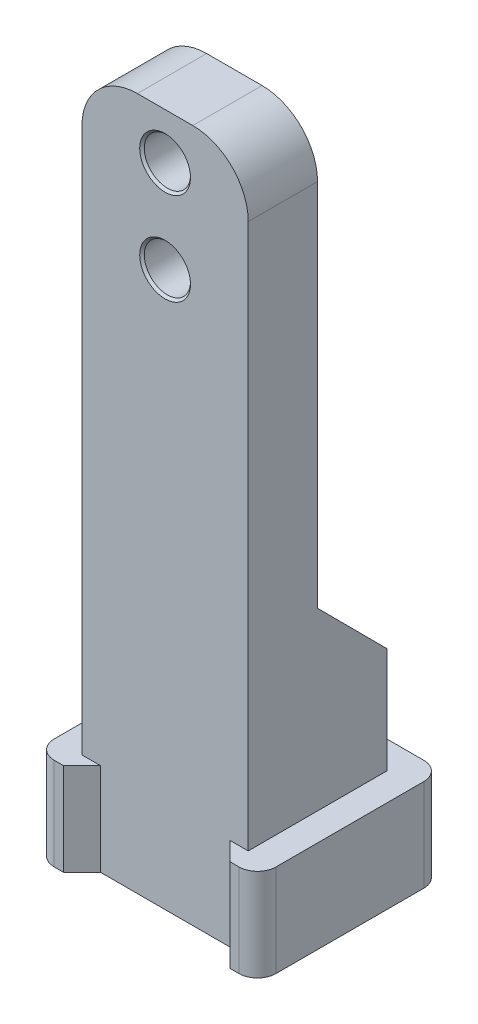
ISO-10303-21;
HEADER;
FILE_DESCRIPTION(('STEP AP214'),'2;1');
FILE_NAME('part.step','',(''),(''),'','','');
FILE_SCHEMA(('AUTOMOTIVE_DESIGN { 1 0 10303 214 1 1 1 1 }'));
ENDSEC;
DATA;
#1=APPLICATION_CONTEXT('core data for automotive mechanical design processes');
#2=APPLICATION_PROTOCOL_DEFINITION('international standard','automotive_design',2000,#1);
#3=PRODUCT_CONTEXT('',#1,'mechanical');
#4=PRODUCT('Part','Part','',(#3));
#5=PRODUCT_RELATED_PRODUCT_CATEGORY('part','',(#4));
#6=PRODUCT_DEFINITION_FORMATION('','',#4);
#7=PRODUCT_DEFINITION_CONTEXT('part definition',#1,'design');
#8=PRODUCT_DEFINITION('design','',#6,#7);
#9=PRODUCT_DEFINITION_SHAPE('','',#8);
#10=(LENGTH_UNIT() NAMED_UNIT(*) SI_UNIT(.MILLI.,.METRE.));
#11=(NAMED_UNIT(*) PLANE_ANGLE_UNIT() SI_UNIT($,.RADIAN.));
#12=(NAMED_UNIT(*) SI_UNIT($,.STERADIAN.) SOLID_ANGLE_UNIT());
#13=UNCERTAINTY_MEASURE_WITH_UNIT(LENGTH_MEASURE(1.E-05),#10,'distance_accuracy_value','');
#14=(GEOMETRIC_REPRESENTATION_CONTEXT(3) GLOBAL_UNCERTAINTY_ASSIGNED_CONTEXT((#13)) GLOBAL_UNIT_ASSIGNED_CONTEXT((#10,
#11,#12)) REPRESENTATION_CONTEXT('',''));
#15=CARTESIAN_POINT('',(0.,0.,0.));
#16=DIRECTION('',(0.,0.,1.));
#17=DIRECTION('',(1.,0.,0.));
#18=AXIS2_PLACEMENT_3D('',#15,#16,#17);
#19=CARTESIAN_POINT('',(0.,75.,0.));
#20=DIRECTION('',(1.,0.,0.));
#21=DIRECTION('',(0.,0.,-1.));
#22=AXIS2_PLACEMENT_3D('',#19,#20,#21);
#23=PLANE('',#22);
#24=DIRECTION('',(0.,0.,1.));
#25=VECTOR('',#24,1.);
#26=CARTESIAN_POINT('',(0.,10.,0.));
#27=LINE('',#26,#25);
#28=CARTESIAN_POINT('',(0.,9.99999999999999,-15.));
#29=VERTEX_POINT('',#28);
#30=CARTESIAN_POINT('',(0.,9.99999999999999,0.));
#31=VERTEX_POINT('',#30);
#32=EDGE_CURVE('E208',#29,#31,#27,.T.);
#33=ORIENTED_EDGE('',*,*,#32,.T.);
#34=DIRECTION('',(0.,-1.,0.));
#35=VECTOR('',#34,1.);
#36=CARTESIAN_POINT('',(0.,75.,0.));
#37=LINE('',#36,#35);
#38=CARTESIAN_POINT('',(0.,69.,0.));
#39=VERTEX_POINT('',#38);
#40=EDGE_CURVE('E353',#39,#31,#37,.T.);
#41=ORIENTED_EDGE('',*,*,#40,.F.);
#42=DIRECTION('',(0.,0.,1.));
#43=VECTOR('',#42,1.);
#44=CARTESIAN_POINT('',(0.,69.,0.));
#45=LINE('',#44,#43);
#46=CARTESIAN_POINT('',(0.,69.,-7.5));
#47=VERTEX_POINT('',#46);
#48=EDGE_CURVE('E384',#39,#47,#45,.F.);
#49=ORIENTED_EDGE('',*,*,#48,.T.);
#50=DIRECTION('',(0.,-1.,0.));
#51=VECTOR('',#50,1.);
#52=CARTESIAN_POINT('',(0.,75.,-7.5));
#53=LINE('',#52,#51);
#54=CARTESIAN_POINT('',(0.,29.,-7.50000000000001));
#55=VERTEX_POINT('',#54);
#56=EDGE_CURVE('E331',#47,#55,#53,.T.);
#57=ORIENTED_EDGE('',*,*,#56,.T.);
#58=DIRECTION('',(0.,-0.708419964654757,-0.705791154434902));
#59=VECTOR('',#58,1.);
#60=CARTESIAN_POINT('',(0.,55.8354810158747,19.2358997077962));
#61=LINE('',#60,#59);
#62=CARTESIAN_POINT('',(0.,21.4720652823076,-15.));
#63=VERTEX_POINT('',#62);
#64=EDGE_CURVE('E323',#55,#63,#61,.T.);
#65=ORIENTED_EDGE('',*,*,#64,.T.);
#66=DIRECTION('',(0.,-1.,0.));
#67=VECTOR('',#66,1.);
#68=CARTESIAN_POINT('',(0.,75.,-15.));
#69=LINE('',#68,#67);
#70=EDGE_CURVE('E338',#63,#29,#69,.T.);
#71=ORIENTED_EDGE('',*,*,#70,.T.);
#72=EDGE_LOOP('',(#33,#41,#49,#57,#65,#71));
#73=FACE_BOUND('',#72,.T.);
#74=ADVANCED_FACE('F44',(#73),#23,.F.);
#75=CARTESIAN_POINT('',(18.,75.,0.));
#76=DIRECTION('',(-1.,0.,0.));
#77=DIRECTION('',(0.,0.,1.));
#78=AXIS2_PLACEMENT_3D('',#75,#76,#77);
#79=PLANE('',#78);
#80=DIRECTION('',(0.,0.,-1.));
#81=VECTOR('',#80,1.);
#82=CARTESIAN_POINT('',(18.,10.,0.));
#83=LINE('',#82,#81);
#84=CARTESIAN_POINT('',(18.,9.99999999999999,0.));
#85=VERTEX_POINT('',#84);
#86=CARTESIAN_POINT('',(18.,9.99999999999999,-15.));
#87=VERTEX_POINT('',#86);
#88=EDGE_CURVE('E425',#85,#87,#83,.T.);
#89=ORIENTED_EDGE('',*,*,#88,.T.);
#90=DIRECTION('',(0.,-1.,0.));
#91=VECTOR('',#90,1.);
#92=CARTESIAN_POINT('',(18.,75.,-15.));
#93=LINE('',#92,#91);
#94=CARTESIAN_POINT('',(18.,21.4720652823076,-15.));
#95=VERTEX_POINT('',#94);
#96=EDGE_CURVE('E345',#95,#87,#93,.T.);
#97=ORIENTED_EDGE('',*,*,#96,.F.);
#98=DIRECTION('',(0.,-0.708419964654757,-0.705791154434902));
#99=VECTOR('',#98,1.);
#100=CARTESIAN_POINT('',(18.,29.,-7.50000000000001));
#101=LINE('',#100,#99);
#102=CARTESIAN_POINT('',(18.,29.,-7.50000000000001));
#103=VERTEX_POINT('',#102);
#104=EDGE_CURVE('E460',#103,#95,#101,.T.);
#105=ORIENTED_EDGE('',*,*,#104,.F.);
#106=DIRECTION('',(0.,-1.,0.));
#107=VECTOR('',#106,1.);
#108=CARTESIAN_POINT('',(18.,75.,-7.5));
#109=LINE('',#108,#107);
#110=CARTESIAN_POINT('',(18.,69.,-7.5));
#111=VERTEX_POINT('',#110);
#112=EDGE_CURVE('E370',#111,#103,#109,.T.);
#113=ORIENTED_EDGE('',*,*,#112,.F.);
#114=DIRECTION('',(0.,0.,-1.));
#115=VECTOR('',#114,1.);
#116=CARTESIAN_POINT('',(18.,69.,0.));
#117=LINE('',#116,#115);
#118=CARTESIAN_POINT('',(18.,69.,0.));
#119=VERTEX_POINT('',#118);
#120=EDGE_CURVE('E393',#111,#119,#117,.F.);
#121=ORIENTED_EDGE('',*,*,#120,.T.);
#122=DIRECTION('',(0.,-1.,0.));
#123=VECTOR('',#122,1.);
#124=CARTESIAN_POINT('',(18.,75.,0.));
#125=LINE('',#124,#123);
#126=EDGE_CURVE('E349',#119,#85,#125,.T.);
#127=ORIENTED_EDGE('',*,*,#126,.T.);
#128=EDGE_LOOP('',(#89,#97,#105,#113,#121,#127));
#129=FACE_BOUND('',#128,.T.);
#130=ADVANCED_FACE('F423',(#129),#79,.F.);
#131=CARTESIAN_POINT('',(0.,75.,-15.));
#132=DIRECTION('',(0.,0.,1.));
#133=DIRECTION('',(1.,0.,0.));
#134=AXIS2_PLACEMENT_3D('',#131,#132,#133);
#135=PLANE('',#134);
#136=DIRECTION('',(-1.,0.,0.));
#137=VECTOR('',#136,1.);
#138=CARTESIAN_POINT('',(0.,10.,-15.));
#139=LINE('',#138,#137);
#140=EDGE_CURVE('E198',#87,#29,#139,.T.);
#141=ORIENTED_EDGE('',*,*,#140,.T.);
#142=ORIENTED_EDGE('',*,*,#70,.F.);
#143=DIRECTION('',(1.,0.,0.));
#144=VECTOR('',#143,1.);
#145=CARTESIAN_POINT('',(-30.,21.4720652823076,-15.));
#146=LINE('',#145,#144);
#147=EDGE_CURVE('E464',#63,#95,#146,.T.);
#148=ORIENTED_EDGE('',*,*,#147,.T.);
#149=ORIENTED_EDGE('',*,*,#96,.T.);
#150=EDGE_LOOP('',(#141,#142,#148,#149));
#151=FACE_BOUND('',#150,.T.);
#152=ADVANCED_FACE('F533',(#151),#135,.F.);
#153=CARTESIAN_POINT('',(0.,75.,0.));
#154=DIRECTION('',(0.,0.,-1.));
#155=DIRECTION('',(-1.,0.,0.));
#156=AXIS2_PLACEMENT_3D('',#153,#154,#155);
#157=PLANE('',#156);
#158=CARTESIAN_POINT('',(9.,70.,0.));
#159=DIRECTION('',(0.,0.,-1.));
#160=DIRECTION('',(-1.,0.,0.));
#161=AXIS2_PLACEMENT_3D('',#158,#159,#160);
#162=CIRCLE('',#161,2.74999999999998);
#163=CARTESIAN_POINT('',(6.25000000000002,70.,0.));
#164=VERTEX_POINT('',#163);
#165=EDGE_CURVE('E284',#164,#164,#162,.T.);
#166=ORIENTED_EDGE('',*,*,#165,.T.);
#167=EDGE_LOOP('',(#166));
#168=FACE_BOUND('',#167,.T.);
#169=CARTESIAN_POINT('',(9.,60.,0.));
#170=DIRECTION('',(0.,0.,-1.));
#171=DIRECTION('',(-1.,0.,0.));
#172=AXIS2_PLACEMENT_3D('',#169,#170,#171);
#173=CIRCLE('',#172,2.75);
#174=CARTESIAN_POINT('',(6.25,60.,0.));
#175=VERTEX_POINT('',#174);
#176=EDGE_CURVE('E280',#175,#175,#173,.T.);
#177=ORIENTED_EDGE('',*,*,#176,.T.);
#178=EDGE_LOOP('',(#177));
#179=FACE_BOUND('',#178,.T.);
#180=DIRECTION('',(1.,0.,0.));
#181=VECTOR('',#180,1.);
#182=CARTESIAN_POINT('',(0.,10.,0.));
#183=LINE('',#182,#181);
#184=CARTESIAN_POINT('',(2.00000000000001,10.,0.));
#185=VERTEX_POINT('',#184);
#186=EDGE_CURVE('E403',#31,#185,#183,.T.);
#187=ORIENTED_EDGE('',*,*,#186,.T.);
#188=DIRECTION('',(0.,-1.,0.));
#189=VECTOR('',#188,1.);
#190=CARTESIAN_POINT('',(2.00000000000001,75.,0.));
#191=LINE('',#190,#189);
#192=CARTESIAN_POINT('',(2.00000000000001,0.,0.));
#193=VERTEX_POINT('',#192);
#194=EDGE_CURVE('E213',#185,#193,#191,.T.);
#195=ORIENTED_EDGE('',*,*,#194,.T.);
#196=DIRECTION('',(1.,0.,0.));
#197=VECTOR('',#196,1.);
#198=CARTESIAN_POINT('',(0.,0.,0.));
#199=LINE('',#198,#197);
#200=CARTESIAN_POINT('',(16.,0.,0.));
#201=VERTEX_POINT('',#200);
#202=EDGE_CURVE('E328',#193,#201,#199,.T.);
#203=ORIENTED_EDGE('',*,*,#202,.T.);
#204=DIRECTION('',(0.,1.,0.));
#205=VECTOR('',#204,1.);
#206=CARTESIAN_POINT('',(16.,75.,0.));
#207=LINE('',#206,#205);
#208=CARTESIAN_POINT('',(16.,10.,0.));
#209=VERTEX_POINT('',#208);
#210=EDGE_CURVE('E399',#201,#209,#207,.T.);
#211=ORIENTED_EDGE('',*,*,#210,.T.);
#212=DIRECTION('',(1.,0.,0.));
#213=VECTOR('',#212,1.);
#214=CARTESIAN_POINT('',(0.,10.,0.));
#215=LINE('',#214,#213);
#216=EDGE_CURVE('E396',#209,#85,#215,.T.);
#217=ORIENTED_EDGE('',*,*,#216,.T.);
#218=ORIENTED_EDGE('',*,*,#126,.F.);
#219=CARTESIAN_POINT('',(12.,69.,0.));
#220=DIRECTION('',(0.,0.,-1.));
#221=DIRECTION('',(-1.,0.,0.));
#222=AXIS2_PLACEMENT_3D('',#219,#220,#221);
#223=CIRCLE('',#222,6.);
#224=CARTESIAN_POINT('',(12.,75.,0.));
#225=VERTEX_POINT('',#224);
#226=EDGE_CURVE('E378',#119,#225,#223,.F.);
#227=ORIENTED_EDGE('',*,*,#226,.T.);
#228=DIRECTION('',(1.,0.,0.));
#229=VECTOR('',#228,1.);
#230=CARTESIAN_POINT('',(0.,75.,0.));
#231=LINE('',#230,#229);
#232=CARTESIAN_POINT('',(6.,75.,0.));
#233=VERTEX_POINT('',#232);
#234=EDGE_CURVE('E334',#233,#225,#231,.T.);
#235=ORIENTED_EDGE('',*,*,#234,.F.);
#236=CARTESIAN_POINT('',(6.,69.,0.));
#237=DIRECTION('',(0.,0.,-1.));
#238=DIRECTION('',(-1.,0.,0.));
#239=AXIS2_PLACEMENT_3D('',#236,#237,#238);
#240=CIRCLE('',#239,6.);
#241=EDGE_CURVE('E381',#233,#39,#240,.F.);
#242=ORIENTED_EDGE('',*,*,#241,.T.);
#243=ORIENTED_EDGE('',*,*,#40,.T.);
#244=EDGE_LOOP('',(#187,#195,#203,#211,#217,#218,#227,#235,#242,#243));
#245=FACE_BOUND('',#244,.T.);
#246=ADVANCED_FACE('F408',(#168,#179,#245),#157,.F.);
#247=CARTESIAN_POINT('',(0.,75.,0.));
#248=DIRECTION('',(0.,-1.,0.));
#249=DIRECTION('',(0.,0.,-1.));
#250=AXIS2_PLACEMENT_3D('',#247,#248,#249);
#251=PLANE('',#250);
#252=DIRECTION('',(-1.,0.,0.));
#253=VECTOR('',#252,1.);
#254=CARTESIAN_POINT('',(0.,75.,-7.5));
#255=LINE('',#254,#253);
#256=CARTESIAN_POINT('',(12.,75.,-7.5));
#257=VERTEX_POINT('',#256);
#258=CARTESIAN_POINT('',(6.,75.,-7.5));
#259=VERTEX_POINT('',#258);
#260=EDGE_CURVE('E357',#257,#259,#255,.T.);
#261=ORIENTED_EDGE('',*,*,#260,.T.);
#262=DIRECTION('',(0.,0.,1.));
#263=VECTOR('',#262,1.);
#264=CARTESIAN_POINT('',(6.,75.,0.));
#265=LINE('',#264,#263);
#266=EDGE_CURVE('E374',#259,#233,#265,.T.);
#267=ORIENTED_EDGE('',*,*,#266,.T.);
#268=ORIENTED_EDGE('',*,*,#234,.T.);
#269=DIRECTION('',(0.,0.,-1.));
#270=VECTOR('',#269,1.);
#271=CARTESIAN_POINT('',(12.,75.,0.));
#272=LINE('',#271,#270);
#273=EDGE_CURVE('E361',#225,#257,#272,.T.);
#274=ORIENTED_EDGE('',*,*,#273,.T.);
#275=EDGE_LOOP('',(#261,#267,#268,#274));
#276=FACE_BOUND('',#275,.T.);
#277=ADVANCED_FACE('F492',(#276),#251,.F.);
#278=CARTESIAN_POINT('',(0.,0.,0.));
#279=DIRECTION('',(0.,-1.,0.));
#280=DIRECTION('',(0.,0.,-1.));
#281=AXIS2_PLACEMENT_3D('',#278,#279,#280);
#282=PLANE('',#281);
#283=CARTESIAN_POINT('',(14.,0.,-6.));
#284=DIRECTION('',(0.,-1.,0.));
#285=DIRECTION('',(0.,0.,-1.));
#286=AXIS2_PLACEMENT_3D('',#283,#284,#285);
#287=CIRCLE('',#286,2.75);
#288=CARTESIAN_POINT('',(14.,0.,-8.75));
#289=VERTEX_POINT('',#288);
#290=EDGE_CURVE('E54',#289,#289,#287,.F.);
#291=ORIENTED_EDGE('',*,*,#290,.T.);
#292=EDGE_LOOP('',(#291));
#293=FACE_BOUND('',#292,.T.);
#294=CARTESIAN_POINT('',(4.,0.,-6.));
#295=DIRECTION('',(0.,-1.,0.));
#296=DIRECTION('',(0.,0.,-1.));
#297=AXIS2_PLACEMENT_3D('',#294,#295,#296);
#298=CIRCLE('',#297,2.75);
#299=CARTESIAN_POINT('',(4.,0.,-8.75));
#300=VERTEX_POINT('',#299);
#301=EDGE_CURVE('E296',#300,#300,#298,.F.);
#302=ORIENTED_EDGE('',*,*,#301,.T.);
#303=EDGE_LOOP('',(#302));
#304=FACE_BOUND('',#303,.T.);
#305=DIRECTION('',(-1.,0.,0.));
#306=VECTOR('',#305,1.);
#307=CARTESIAN_POINT('',(0.,0.,2.));
#308=LINE('',#307,#306);
#309=CARTESIAN_POINT('',(0.,0.,2.));
#310=VERTEX_POINT('',#309);
#311=CARTESIAN_POINT('',(-1.,0.,2.));
#312=VERTEX_POINT('',#311);
#313=EDGE_CURVE('E193',#310,#312,#308,.T.);
#314=ORIENTED_EDGE('',*,*,#313,.T.);
#315=CARTESIAN_POINT('',(-1.,0.,0.));
#316=DIRECTION('',(0.,-1.,0.));
#317=DIRECTION('',(0.,0.,-1.));
#318=AXIS2_PLACEMENT_3D('',#315,#316,#317);
#319=CIRCLE('',#318,2.);
#320=CARTESIAN_POINT('',(-3.,0.,0.));
#321=VERTEX_POINT('',#320);
#322=EDGE_CURVE('E240',#312,#321,#319,.T.);
#323=ORIENTED_EDGE('',*,*,#322,.T.);
#324=DIRECTION('',(0.,0.,-1.));
#325=VECTOR('',#324,1.);
#326=CARTESIAN_POINT('',(-3.,0.,2.));
#327=LINE('',#326,#325);
#328=CARTESIAN_POINT('',(-3.,0.,-16.));
#329=VERTEX_POINT('',#328);
#330=EDGE_CURVE('E442',#321,#329,#327,.T.);
#331=ORIENTED_EDGE('',*,*,#330,.T.);
#332=CARTESIAN_POINT('',(-0.999999999999998,0.,-16.));
#333=DIRECTION('',(0.,-1.,0.));
#334=DIRECTION('',(0.,0.,-1.));
#335=AXIS2_PLACEMENT_3D('',#332,#333,#334);
#336=CIRCLE('',#335,2.);
#337=CARTESIAN_POINT('',(-0.999999999999997,0.,-18.));
#338=VERTEX_POINT('',#337);
#339=EDGE_CURVE('E231',#329,#338,#336,.T.);
#340=ORIENTED_EDGE('',*,*,#339,.T.);
#341=DIRECTION('',(1.,0.,0.));
#342=VECTOR('',#341,1.);
#343=CARTESIAN_POINT('',(21.,0.,-18.));
#344=LINE('',#343,#342);
#345=CARTESIAN_POINT('',(19.,0.,-18.));
#346=VERTEX_POINT('',#345);
#347=EDGE_CURVE('E446',#338,#346,#344,.T.);
#348=ORIENTED_EDGE('',*,*,#347,.T.);
#349=CARTESIAN_POINT('',(19.,0.,-16.));
#350=DIRECTION('',(0.,-1.,0.));
#351=DIRECTION('',(0.,0.,-1.));
#352=AXIS2_PLACEMENT_3D('',#349,#350,#351);
#353=CIRCLE('',#352,2.);
#354=CARTESIAN_POINT('',(21.,0.,-16.));
#355=VERTEX_POINT('',#354);
#356=EDGE_CURVE('E234',#346,#355,#353,.T.);
#357=ORIENTED_EDGE('',*,*,#356,.T.);
#358=DIRECTION('',(0.,0.,1.));
#359=VECTOR('',#358,1.);
#360=CARTESIAN_POINT('',(21.,0.,2.));
#361=LINE('',#360,#359);
#362=CARTESIAN_POINT('',(21.,0.,0.));
#363=VERTEX_POINT('',#362);
#364=EDGE_CURVE('E450',#355,#363,#361,.T.);
#365=ORIENTED_EDGE('',*,*,#364,.T.);
#366=CARTESIAN_POINT('',(19.,0.,0.));
#367=DIRECTION('',(0.,-1.,0.));
#368=DIRECTION('',(0.,0.,-1.));
#369=AXIS2_PLACEMENT_3D('',#366,#367,#368);
#370=CIRCLE('',#369,2.);
#371=CARTESIAN_POINT('',(19.,0.,2.));
#372=VERTEX_POINT('',#371);
#373=EDGE_CURVE('E237',#363,#372,#370,.T.);
#374=ORIENTED_EDGE('',*,*,#373,.T.);
#375=DIRECTION('',(-1.,0.,0.));
#376=VECTOR('',#375,1.);
#377=CARTESIAN_POINT('',(18.,0.,2.));
#378=LINE('',#377,#376);
#379=CARTESIAN_POINT('',(18.,0.,2.));
#380=VERTEX_POINT('',#379);
#381=EDGE_CURVE('E413',#372,#380,#378,.T.);
#382=ORIENTED_EDGE('',*,*,#381,.T.);
#383=DIRECTION('',(-0.707106781186551,0.,-0.707106781186544));
#384=VECTOR('',#383,1.);
#385=CARTESIAN_POINT('',(16.,0.,0.));
#386=LINE('',#385,#384);
#387=EDGE_CURVE('E221',#380,#201,#386,.T.);
#388=ORIENTED_EDGE('',*,*,#387,.T.);
#389=ORIENTED_EDGE('',*,*,#202,.F.);
#390=DIRECTION('',(-0.707106781186551,0.,0.707106781186544));
#391=VECTOR('',#390,1.);
#392=CARTESIAN_POINT('',(2.00000000000001,0.,0.));
#393=LINE('',#392,#391);
#394=EDGE_CURVE('E216',#193,#310,#393,.T.);
#395=ORIENTED_EDGE('',*,*,#394,.T.);
#396=EDGE_LOOP('',(#314,#323,#331,#340,#348,#357,#365,#374,#382,#388,#389,#395));
#397=FACE_BOUND('',#396,.T.);
#398=ADVANCED_FACE('F303',(#293,#304,#397),#282,.T.);
#399=CARTESIAN_POINT('',(14.,12.,-6.));
#400=DIRECTION('',(0.,-1.,0.));
#401=DIRECTION('',(0.,0.,-1.));
#402=AXIS2_PLACEMENT_3D('',#399,#400,#401);
#403=CYLINDRICAL_SURFACE('',#402,2.5);
#404=CARTESIAN_POINT('',(14.,0.249999999999999,-6.));
#405=DIRECTION('',(0.,-1.,0.));
#406=DIRECTION('',(0.,0.,-1.));
#407=AXIS2_PLACEMENT_3D('',#404,#405,#406);
#408=CIRCLE('',#407,2.5);
#409=CARTESIAN_POINT('',(14.,0.249999999999999,-8.5));
#410=VERTEX_POINT('',#409);
#411=EDGE_CURVE('E292',#410,#410,#408,.T.);
#412=ORIENTED_EDGE('',*,*,#411,.T.);
#413=EDGE_LOOP('',(#412));
#414=FACE_BOUND('',#413,.T.);
#415=CARTESIAN_POINT('',(14.,12.,-6.));
#416=DIRECTION('',(0.,-1.,0.));
#417=DIRECTION('',(0.,0.,-1.));
#418=AXIS2_PLACEMENT_3D('',#415,#416,#417);
#419=CIRCLE('',#418,2.5);
#420=CARTESIAN_POINT('',(14.,12.,-8.5));
#421=VERTEX_POINT('',#420);
#422=EDGE_CURVE('E319',#421,#421,#419,.T.);
#423=ORIENTED_EDGE('',*,*,#422,.F.);
#424=EDGE_LOOP('',(#423));
#425=FACE_BOUND('',#424,.T.);
#426=ADVANCED_FACE('F312',(#414,#425),#403,.F.);
#427=CARTESIAN_POINT('',(0.,12.,0.));
#428=DIRECTION('',(0.,-1.,0.));
#429=DIRECTION('',(0.,0.,-1.));
#430=AXIS2_PLACEMENT_3D('',#427,#428,#429);
#431=PLANE('',#430);
#432=ORIENTED_EDGE('',*,*,#422,.T.);
#433=EDGE_LOOP('',(#432));
#434=FACE_BOUND('',#433,.T.);
#435=ADVANCED_FACE('F315',(#434),#431,.T.);
#436=CARTESIAN_POINT('',(4.,12.,-6.));
#437=DIRECTION('',(0.,-1.,0.));
#438=DIRECTION('',(0.,0.,-1.));
#439=AXIS2_PLACEMENT_3D('',#436,#437,#438);
#440=CYLINDRICAL_SURFACE('',#439,2.5);
#441=CARTESIAN_POINT('',(4.,0.249999999999997,-6.));
#442=DIRECTION('',(0.,-1.,0.));
#443=DIRECTION('',(0.,0.,-1.));
#444=AXIS2_PLACEMENT_3D('',#441,#442,#443);
#445=CIRCLE('',#444,2.5);
#446=CARTESIAN_POINT('',(4.,0.249999999999997,-8.5));
#447=VERTEX_POINT('',#446);
#448=EDGE_CURVE('E11',#447,#447,#445,.T.);
#449=ORIENTED_EDGE('',*,*,#448,.T.);
#450=EDGE_LOOP('',(#449));
#451=FACE_BOUND('',#450,.T.);
#452=CARTESIAN_POINT('',(4.,12.,-6.));
#453=DIRECTION('',(0.,-1.,0.));
#454=DIRECTION('',(0.,0.,-1.));
#455=AXIS2_PLACEMENT_3D('',#452,#453,#454);
#456=CIRCLE('',#455,2.5);
#457=CARTESIAN_POINT('',(4.,12.,-8.5));
#458=VERTEX_POINT('',#457);
#459=EDGE_CURVE('E322',#458,#458,#456,.T.);
#460=ORIENTED_EDGE('',*,*,#459,.F.);
#461=EDGE_LOOP('',(#460));
#462=FACE_BOUND('',#461,.T.);
#463=ADVANCED_FACE('F605',(#451,#462),#440,.F.);
#464=CARTESIAN_POINT('',(0.,12.,0.));
#465=DIRECTION('',(0.,-1.,0.));
#466=DIRECTION('',(0.,0.,-1.));
#467=AXIS2_PLACEMENT_3D('',#464,#465,#466);
#468=PLANE('',#467);
#469=ORIENTED_EDGE('',*,*,#459,.T.);
#470=EDGE_LOOP('',(#469));
#471=FACE_BOUND('',#470,.T.);
#472=ADVANCED_FACE('F600',(#471),#468,.T.);
#473=CARTESIAN_POINT('',(-30.,29.,-7.50000000000001));
#474=DIRECTION('',(0.,-0.705791154434902,0.708419964654757));
#475=DIRECTION('',(0.,-0.708419964654757,-0.705791154434902));
#476=AXIS2_PLACEMENT_3D('',#473,#474,#475);
#477=PLANE('',#476);
#478=DIRECTION('',(1.,0.,0.));
#479=VECTOR('',#478,1.);
#480=CARTESIAN_POINT('',(-30.,29.,-7.50000000000001));
#481=LINE('',#480,#479);
#482=EDGE_CURVE('E463',#55,#103,#481,.T.);
#483=ORIENTED_EDGE('',*,*,#482,.T.);
#484=ORIENTED_EDGE('',*,*,#104,.T.);
#485=ORIENTED_EDGE('',*,*,#147,.F.);
#486=ORIENTED_EDGE('',*,*,#64,.F.);
#487=EDGE_LOOP('',(#483,#484,#485,#486));
#488=FACE_BOUND('',#487,.T.);
#489=ADVANCED_FACE('F483',(#488),#477,.F.);
#490=CARTESIAN_POINT('',(-30.,75.,-7.5));
#491=DIRECTION('',(0.,0.,1.));
#492=DIRECTION('',(0.,-1.,0.));
#493=AXIS2_PLACEMENT_3D('',#490,#491,#492);
#494=PLANE('',#493);
#495=CARTESIAN_POINT('',(9.,70.,-7.5));
#496=DIRECTION('',(0.,0.,1.));
#497=DIRECTION('',(0.,-1.,0.));
#498=AXIS2_PLACEMENT_3D('',#495,#496,#497);
#499=CIRCLE('',#498,2.5);
#500=CARTESIAN_POINT('',(9.,67.5,-7.5));
#501=VERTEX_POINT('',#500);
#502=EDGE_CURVE('E366',#501,#501,#499,.T.);
#503=ORIENTED_EDGE('',*,*,#502,.T.);
#504=EDGE_LOOP('',(#503));
#505=FACE_BOUND('',#504,.T.);
#506=CARTESIAN_POINT('',(9.,60.,-7.5));
#507=DIRECTION('',(0.,0.,1.));
#508=DIRECTION('',(0.,-1.,0.));
#509=AXIS2_PLACEMENT_3D('',#506,#507,#508);
#510=CIRCLE('',#509,2.5);
#511=CARTESIAN_POINT('',(9.,57.5,-7.5));
#512=VERTEX_POINT('',#511);
#513=EDGE_CURVE('E362',#512,#512,#510,.T.);
#514=ORIENTED_EDGE('',*,*,#513,.T.);
#515=EDGE_LOOP('',(#514));
#516=FACE_BOUND('',#515,.T.);
#517=ORIENTED_EDGE('',*,*,#56,.F.);
#518=CARTESIAN_POINT('',(6.,69.,-7.5));
#519=DIRECTION('',(0.,0.,1.));
#520=DIRECTION('',(0.,-1.,0.));
#521=AXIS2_PLACEMENT_3D('',#518,#519,#520);
#522=CIRCLE('',#521,6.);
#523=EDGE_CURVE('E390',#47,#259,#522,.F.);
#524=ORIENTED_EDGE('',*,*,#523,.T.);
#525=ORIENTED_EDGE('',*,*,#260,.F.);
#526=CARTESIAN_POINT('',(12.,69.,-7.5));
#527=DIRECTION('',(0.,0.,1.));
#528=DIRECTION('',(0.,-1.,0.));
#529=AXIS2_PLACEMENT_3D('',#526,#527,#528);
#530=CIRCLE('',#529,6.);
#531=EDGE_CURVE('E387',#257,#111,#530,.F.);
#532=ORIENTED_EDGE('',*,*,#531,.T.);
#533=ORIENTED_EDGE('',*,*,#112,.T.);
#534=ORIENTED_EDGE('',*,*,#482,.F.);
#535=EDGE_LOOP('',(#517,#524,#525,#532,#533,#534));
#536=FACE_BOUND('',#535,.T.);
#537=ADVANCED_FACE('F485',(#505,#516,#536),#494,.F.);
#538=CARTESIAN_POINT('',(9.,60.,-48.));
#539=DIRECTION('',(0.,0.,1.));
#540=DIRECTION('',(1.,0.,0.));
#541=AXIS2_PLACEMENT_3D('',#538,#539,#540);
#542=CYLINDRICAL_SURFACE('',#541,2.5);
#543=CARTESIAN_POINT('',(9.,60.,-0.25));
#544=DIRECTION('',(0.,0.,-1.));
#545=DIRECTION('',(-1.,0.,0.));
#546=AXIS2_PLACEMENT_3D('',#543,#544,#545);
#547=CIRCLE('',#546,2.5);
#548=CARTESIAN_POINT('',(6.5,60.,-0.25));
#549=VERTEX_POINT('',#548);
#550=EDGE_CURVE('E288',#549,#549,#547,.F.);
#551=ORIENTED_EDGE('',*,*,#550,.T.);
#552=EDGE_LOOP('',(#551));
#553=FACE_BOUND('',#552,.T.);
#554=ORIENTED_EDGE('',*,*,#513,.F.);
#555=EDGE_LOOP('',(#554));
#556=FACE_BOUND('',#555,.T.);
#557=ADVANCED_FACE('F587',(#553,#556),#542,.F.);
#558=CARTESIAN_POINT('',(9.,70.,-48.));
#559=DIRECTION('',(0.,0.,1.));
#560=DIRECTION('',(1.,0.,0.));
#561=AXIS2_PLACEMENT_3D('',#558,#559,#560);
#562=CYLINDRICAL_SURFACE('',#561,2.5);
#563=CARTESIAN_POINT('',(9.,70.,-0.249999999999986));
#564=DIRECTION('',(0.,0.,-1.));
#565=DIRECTION('',(-1.,0.,0.));
#566=AXIS2_PLACEMENT_3D('',#563,#564,#565);
#567=CIRCLE('',#566,2.5);
#568=CARTESIAN_POINT('',(6.5,70.,-0.249999999999986));
#569=VERTEX_POINT('',#568);
#570=EDGE_CURVE('E276',#569,#569,#567,.F.);
#571=ORIENTED_EDGE('',*,*,#570,.T.);
#572=EDGE_LOOP('',(#571));
#573=FACE_BOUND('',#572,.T.);
#574=ORIENTED_EDGE('',*,*,#502,.F.);
#575=EDGE_LOOP('',(#574));
#576=FACE_BOUND('',#575,.T.);
#577=ADVANCED_FACE('F538',(#573,#576),#562,.F.);
#578=CARTESIAN_POINT('',(6.,69.,0.));
#579=DIRECTION('',(0.,0.,1.));
#580=DIRECTION('',(1.,0.,0.));
#581=AXIS2_PLACEMENT_3D('',#578,#579,#580);
#582=CYLINDRICAL_SURFACE('',#581,6.);
#583=ORIENTED_EDGE('',*,*,#523,.F.);
#584=ORIENTED_EDGE('',*,*,#48,.F.);
#585=ORIENTED_EDGE('',*,*,#241,.F.);
#586=ORIENTED_EDGE('',*,*,#266,.F.);
#587=EDGE_LOOP('',(#583,#584,#585,#586));
#588=FACE_BOUND('',#587,.T.);
#589=ADVANCED_FACE('F495',(#588),#582,.T.);
#590=CARTESIAN_POINT('',(12.,69.,0.));
#591=DIRECTION('',(0.,0.,-1.));
#592=DIRECTION('',(-1.,0.,0.));
#593=AXIS2_PLACEMENT_3D('',#590,#591,#592);
#594=CYLINDRICAL_SURFACE('',#593,6.);
#595=ORIENTED_EDGE('',*,*,#226,.F.);
#596=ORIENTED_EDGE('',*,*,#120,.F.);
#597=ORIENTED_EDGE('',*,*,#531,.F.);
#598=ORIENTED_EDGE('',*,*,#273,.F.);
#599=EDGE_LOOP('',(#595,#596,#597,#598));
#600=FACE_BOUND('',#599,.T.);
#601=ADVANCED_FACE('F488',(#600),#594,.T.);
#602=CARTESIAN_POINT('',(18.,10.,2.));
#603=DIRECTION('',(0.,0.,1.));
#604=DIRECTION('',(1.,0.,0.));
#605=AXIS2_PLACEMENT_3D('',#602,#603,#604);
#606=PLANE('',#605);
#607=ORIENTED_EDGE('',*,*,#381,.F.);
#608=DIRECTION('',(0.,-1.,0.));
#609=VECTOR('',#608,1.);
#610=CARTESIAN_POINT('',(19.,10.,2.));
#611=LINE('',#610,#609);
#612=CARTESIAN_POINT('',(19.,10.,2.));
#613=VERTEX_POINT('',#612);
#614=EDGE_CURVE('E267',#372,#613,#611,.F.);
#615=ORIENTED_EDGE('',*,*,#614,.T.);
#616=DIRECTION('',(-1.,0.,0.));
#617=VECTOR('',#616,1.);
#618=CARTESIAN_POINT('',(18.,10.,2.));
#619=LINE('',#618,#617);
#620=CARTESIAN_POINT('',(18.,10.,2.));
#621=VERTEX_POINT('',#620);
#622=EDGE_CURVE('E431',#613,#621,#619,.T.);
#623=ORIENTED_EDGE('',*,*,#622,.T.);
#624=DIRECTION('',(0.,-1.,0.));
#625=VECTOR('',#624,1.);
#626=CARTESIAN_POINT('',(18.,10.,2.));
#627=LINE('',#626,#625);
#628=EDGE_CURVE('E197',#621,#380,#627,.T.);
#629=ORIENTED_EDGE('',*,*,#628,.T.);
#630=EDGE_LOOP('',(#607,#615,#623,#629));
#631=FACE_BOUND('',#630,.T.);
#632=ADVANCED_FACE('F516',(#631),#606,.T.);
#633=CARTESIAN_POINT('',(21.,10.,2.));
#634=DIRECTION('',(1.,0.,0.));
#635=DIRECTION('',(0.,0.,-1.));
#636=AXIS2_PLACEMENT_3D('',#633,#634,#635);
#637=PLANE('',#636);
#638=DIRECTION('',(0.,0.,1.));
#639=VECTOR('',#638,1.);
#640=CARTESIAN_POINT('',(21.,10.,2.));
#641=LINE('',#640,#639);
#642=CARTESIAN_POINT('',(21.,10.,-16.));
#643=VERTEX_POINT('',#642);
#644=CARTESIAN_POINT('',(21.,10.,0.));
#645=VERTEX_POINT('',#644);
#646=EDGE_CURVE('E436',#643,#645,#641,.T.);
#647=ORIENTED_EDGE('',*,*,#646,.T.);
#648=DIRECTION('',(0.,-1.,0.));
#649=VECTOR('',#648,1.);
#650=CARTESIAN_POINT('',(21.,10.,0.));
#651=LINE('',#650,#649);
#652=EDGE_CURVE('E263',#645,#363,#651,.T.);
#653=ORIENTED_EDGE('',*,*,#652,.T.);
#654=ORIENTED_EDGE('',*,*,#364,.F.);
#655=DIRECTION('',(0.,-1.,0.));
#656=VECTOR('',#655,1.);
#657=CARTESIAN_POINT('',(21.,10.,-16.));
#658=LINE('',#657,#656);
#659=EDGE_CURVE('E260',#355,#643,#658,.F.);
#660=ORIENTED_EDGE('',*,*,#659,.T.);
#661=EDGE_LOOP('',(#647,#653,#654,#660));
#662=FACE_BOUND('',#661,.T.);
#663=ADVANCED_FACE('F508',(#662),#637,.T.);
#664=CARTESIAN_POINT('',(21.,10.,-18.));
#665=DIRECTION('',(0.,0.,-1.));
#666=DIRECTION('',(-1.,0.,0.));
#667=AXIS2_PLACEMENT_3D('',#664,#665,#666);
#668=PLANE('',#667);
#669=DIRECTION('',(1.,0.,0.));
#670=VECTOR('',#669,1.);
#671=CARTESIAN_POINT('',(21.,10.,-18.));
#672=LINE('',#671,#670);
#673=CARTESIAN_POINT('',(-0.999999999999997,10.,-18.));
#674=VERTEX_POINT('',#673);
#675=CARTESIAN_POINT('',(19.,10.,-18.));
#676=VERTEX_POINT('',#675);
#677=EDGE_CURVE('E502',#674,#676,#672,.T.);
#678=ORIENTED_EDGE('',*,*,#677,.T.);
#679=DIRECTION('',(0.,-1.,0.));
#680=VECTOR('',#679,1.);
#681=CARTESIAN_POINT('',(19.,10.,-18.));
#682=LINE('',#681,#680);
#683=EDGE_CURVE('E272',#676,#346,#682,.T.);
#684=ORIENTED_EDGE('',*,*,#683,.T.);
#685=ORIENTED_EDGE('',*,*,#347,.F.);
#686=DIRECTION('',(0.,-1.,0.));
#687=VECTOR('',#686,1.);
#688=CARTESIAN_POINT('',(-0.999999999999997,10.,-18.));
#689=LINE('',#688,#687);
#690=EDGE_CURVE('E68',#338,#674,#689,.F.);
#691=ORIENTED_EDGE('',*,*,#690,.T.);
#692=EDGE_LOOP('',(#678,#684,#685,#691));
#693=FACE_BOUND('',#692,.T.);
#694=ADVANCED_FACE('F524',(#693),#668,.T.);
#695=CARTESIAN_POINT('',(-3.,10.,2.));
#696=DIRECTION('',(-1.,0.,0.));
#697=DIRECTION('',(0.,0.,1.));
#698=AXIS2_PLACEMENT_3D('',#695,#696,#697);
#699=PLANE('',#698);
#700=ORIENTED_EDGE('',*,*,#330,.F.);
#701=DIRECTION('',(0.,-1.,0.));
#702=VECTOR('',#701,1.);
#703=CARTESIAN_POINT('',(-3.,10.,0.));
#704=LINE('',#703,#702);
#705=CARTESIAN_POINT('',(-3.,10.,0.));
#706=VERTEX_POINT('',#705);
#707=EDGE_CURVE('E247',#321,#706,#704,.F.);
#708=ORIENTED_EDGE('',*,*,#707,.T.);
#709=DIRECTION('',(0.,0.,-1.));
#710=VECTOR('',#709,1.);
#711=CARTESIAN_POINT('',(-3.,10.,2.));
#712=LINE('',#711,#710);
#713=CARTESIAN_POINT('',(-3.,10.,-16.));
#714=VERTEX_POINT('',#713);
#715=EDGE_CURVE('E207',#706,#714,#712,.T.);
#716=ORIENTED_EDGE('',*,*,#715,.T.);
#717=DIRECTION('',(0.,-1.,0.));
#718=VECTOR('',#717,1.);
#719=CARTESIAN_POINT('',(-3.,10.,-16.));
#720=LINE('',#719,#718);
#721=EDGE_CURVE('E243',#714,#329,#720,.T.);
#722=ORIENTED_EDGE('',*,*,#721,.T.);
#723=EDGE_LOOP('',(#700,#708,#716,#722));
#724=FACE_BOUND('',#723,.T.);
#725=ADVANCED_FACE('F640',(#724),#699,.T.);
#726=CARTESIAN_POINT('',(0.,10.,2.));
#727=DIRECTION('',(0.,0.,1.));
#728=DIRECTION('',(1.,0.,0.));
#729=AXIS2_PLACEMENT_3D('',#726,#727,#728);
#730=PLANE('',#729);
#731=DIRECTION('',(-1.,0.,0.));
#732=VECTOR('',#731,1.);
#733=CARTESIAN_POINT('',(0.,10.,2.));
#734=LINE('',#733,#732);
#735=CARTESIAN_POINT('',(0.,10.,2.));
#736=VERTEX_POINT('',#735);
#737=CARTESIAN_POINT('',(-1.,10.,2.));
#738=VERTEX_POINT('',#737);
#739=EDGE_CURVE('E190',#736,#738,#734,.T.);
#740=ORIENTED_EDGE('',*,*,#739,.T.);
#741=DIRECTION('',(0.,-1.,0.));
#742=VECTOR('',#741,1.);
#743=CARTESIAN_POINT('',(-1.,10.,2.));
#744=LINE('',#743,#742);
#745=EDGE_CURVE('E228',#738,#312,#744,.T.);
#746=ORIENTED_EDGE('',*,*,#745,.T.);
#747=ORIENTED_EDGE('',*,*,#313,.F.);
#748=DIRECTION('',(0.,-1.,0.));
#749=VECTOR('',#748,1.);
#750=CARTESIAN_POINT('',(0.,10.,2.));
#751=LINE('',#750,#749);
#752=EDGE_CURVE('E186',#736,#310,#751,.T.);
#753=ORIENTED_EDGE('',*,*,#752,.F.);
#754=EDGE_LOOP('',(#740,#746,#747,#753));
#755=FACE_BOUND('',#754,.T.);
#756=ADVANCED_FACE('F188',(#755),#730,.T.);
#757=CARTESIAN_POINT('',(0.,10.,0.));
#758=DIRECTION('',(0.,-1.,0.));
#759=DIRECTION('',(0.,0.,-1.));
#760=AXIS2_PLACEMENT_3D('',#757,#758,#759);
#761=PLANE('',#760);
#762=ORIENTED_EDGE('',*,*,#715,.F.);
#763=CARTESIAN_POINT('',(-1.,10.,0.));
#764=DIRECTION('',(0.,-1.,0.));
#765=DIRECTION('',(0.,0.,-1.));
#766=AXIS2_PLACEMENT_3D('',#763,#764,#765);
#767=CIRCLE('',#766,2.);
#768=EDGE_CURVE('E205',#706,#738,#767,.F.);
#769=ORIENTED_EDGE('',*,*,#768,.T.);
#770=ORIENTED_EDGE('',*,*,#739,.F.);
#771=DIRECTION('',(0.707106781186551,0.,-0.707106781186544));
#772=VECTOR('',#771,1.);
#773=CARTESIAN_POINT('',(0.999999999999994,10.,1.));
#774=LINE('',#773,#772);
#775=EDGE_CURVE('E202',#736,#185,#774,.T.);
#776=ORIENTED_EDGE('',*,*,#775,.T.);
#777=ORIENTED_EDGE('',*,*,#186,.F.);
#778=ORIENTED_EDGE('',*,*,#32,.F.);
#779=ORIENTED_EDGE('',*,*,#140,.F.);
#780=ORIENTED_EDGE('',*,*,#88,.F.);
#781=ORIENTED_EDGE('',*,*,#216,.F.);
#782=DIRECTION('',(0.707106781186551,0.,0.707106781186544));
#783=VECTOR('',#782,1.);
#784=CARTESIAN_POINT('',(7.99999999999991,10.,-8.));
#785=LINE('',#784,#783);
#786=EDGE_CURVE('E215',#209,#621,#785,.T.);
#787=ORIENTED_EDGE('',*,*,#786,.T.);
#788=ORIENTED_EDGE('',*,*,#622,.F.);
#789=CARTESIAN_POINT('',(19.,10.,0.));
#790=DIRECTION('',(0.,-1.,0.));
#791=DIRECTION('',(0.,0.,-1.));
#792=AXIS2_PLACEMENT_3D('',#789,#790,#791);
#793=CIRCLE('',#792,2.);
#794=EDGE_CURVE('E255',#613,#645,#793,.F.);
#795=ORIENTED_EDGE('',*,*,#794,.T.);
#796=ORIENTED_EDGE('',*,*,#646,.F.);
#797=CARTESIAN_POINT('',(19.,10.,-16.));
#798=DIRECTION('',(0.,-1.,0.));
#799=DIRECTION('',(0.,0.,-1.));
#800=AXIS2_PLACEMENT_3D('',#797,#798,#799);
#801=CIRCLE('',#800,2.);
#802=EDGE_CURVE('E61',#643,#676,#801,.F.);
#803=ORIENTED_EDGE('',*,*,#802,.T.);
#804=ORIENTED_EDGE('',*,*,#677,.F.);
#805=CARTESIAN_POINT('',(-0.999999999999998,10.,-16.));
#806=DIRECTION('',(0.,-1.,0.));
#807=DIRECTION('',(0.,0.,-1.));
#808=AXIS2_PLACEMENT_3D('',#805,#806,#807);
#809=CIRCLE('',#808,2.);
#810=EDGE_CURVE('E250',#674,#714,#809,.F.);
#811=ORIENTED_EDGE('',*,*,#810,.T.);
#812=EDGE_LOOP('',(#762,#769,#770,#776,#777,#778,#779,#780,#781,#787,#788,#795,#796,#803,#804,#811));
#813=FACE_BOUND('',#812,.T.);
#814=ADVANCED_FACE('F201',(#813),#761,.F.);
#815=CARTESIAN_POINT('',(2.00000000000001,75.,0.));
#816=DIRECTION('',(-0.707106781186544,0.,-0.707106781186551));
#817=DIRECTION('',(0.,-1.,0.));
#818=AXIS2_PLACEMENT_3D('',#815,#816,#817);
#819=PLANE('',#818);
#820=ORIENTED_EDGE('',*,*,#775,.F.);
#821=ORIENTED_EDGE('',*,*,#752,.T.);
#822=ORIENTED_EDGE('',*,*,#394,.F.);
#823=ORIENTED_EDGE('',*,*,#194,.F.);
#824=EDGE_LOOP('',(#820,#821,#822,#823));
#825=FACE_BOUND('',#824,.T.);
#826=ADVANCED_FACE('F211',(#825),#819,.F.);
#827=CARTESIAN_POINT('',(16.,75.,0.));
#828=DIRECTION('',(0.707106781186544,0.,-0.707106781186551));
#829=DIRECTION('',(0.,1.,0.));
#830=AXIS2_PLACEMENT_3D('',#827,#828,#829);
#831=PLANE('',#830);
#832=ORIENTED_EDGE('',*,*,#387,.F.);
#833=ORIENTED_EDGE('',*,*,#628,.F.);
#834=ORIENTED_EDGE('',*,*,#786,.F.);
#835=ORIENTED_EDGE('',*,*,#210,.F.);
#836=EDGE_LOOP('',(#832,#833,#834,#835));
#837=FACE_BOUND('',#836,.T.);
#838=ADVANCED_FACE('F417',(#837),#831,.F.);
#839=CARTESIAN_POINT('',(-1.,10.,0.));
#840=DIRECTION('',(0.,-1.,0.));
#841=DIRECTION('',(0.,0.,-1.));
#842=AXIS2_PLACEMENT_3D('',#839,#840,#841);
#843=CYLINDRICAL_SURFACE('',#842,2.);
#844=ORIENTED_EDGE('',*,*,#768,.F.);
#845=ORIENTED_EDGE('',*,*,#707,.F.);
#846=ORIENTED_EDGE('',*,*,#322,.F.);
#847=ORIENTED_EDGE('',*,*,#745,.F.);
#848=EDGE_LOOP('',(#844,#845,#846,#847));
#849=FACE_BOUND('',#848,.T.);
#850=ADVANCED_FACE('F551',(#849),#843,.T.);
#851=CARTESIAN_POINT('',(19.,10.,0.));
#852=DIRECTION('',(0.,-1.,0.));
#853=DIRECTION('',(0.,0.,-1.));
#854=AXIS2_PLACEMENT_3D('',#851,#852,#853);
#855=CYLINDRICAL_SURFACE('',#854,2.);
#856=ORIENTED_EDGE('',*,*,#794,.F.);
#857=ORIENTED_EDGE('',*,*,#614,.F.);
#858=ORIENTED_EDGE('',*,*,#373,.F.);
#859=ORIENTED_EDGE('',*,*,#652,.F.);
#860=EDGE_LOOP('',(#856,#857,#858,#859));
#861=FACE_BOUND('',#860,.T.);
#862=ADVANCED_FACE('F513',(#861),#855,.T.);
#863=CARTESIAN_POINT('',(19.,10.,-16.));
#864=DIRECTION('',(0.,-1.,0.));
#865=DIRECTION('',(0.,0.,-1.));
#866=AXIS2_PLACEMENT_3D('',#863,#864,#865);
#867=CYLINDRICAL_SURFACE('',#866,2.);
#868=ORIENTED_EDGE('',*,*,#802,.F.);
#869=ORIENTED_EDGE('',*,*,#659,.F.);
#870=ORIENTED_EDGE('',*,*,#356,.F.);
#871=ORIENTED_EDGE('',*,*,#683,.F.);
#872=EDGE_LOOP('',(#868,#869,#870,#871));
#873=FACE_BOUND('',#872,.T.);
#874=ADVANCED_FACE('F557',(#873),#867,.T.);
#875=CARTESIAN_POINT('',(-0.999999999999998,10.,-16.));
#876=DIRECTION('',(0.,-1.,0.));
#877=DIRECTION('',(0.,0.,-1.));
#878=AXIS2_PLACEMENT_3D('',#875,#876,#877);
#879=CYLINDRICAL_SURFACE('',#878,2.);
#880=ORIENTED_EDGE('',*,*,#810,.F.);
#881=ORIENTED_EDGE('',*,*,#690,.F.);
#882=ORIENTED_EDGE('',*,*,#339,.F.);
#883=ORIENTED_EDGE('',*,*,#721,.F.);
#884=EDGE_LOOP('',(#880,#881,#882,#883));
#885=FACE_BOUND('',#884,.T.);
#886=ADVANCED_FACE('F560',(#885),#879,.T.);
#887=CARTESIAN_POINT('',(9.,70.,-0.249999999999986));
#888=DIRECTION('',(0.,0.,1.));
#889=DIRECTION('',(1.,0.,0.));
#890=AXIS2_PLACEMENT_3D('',#887,#888,#889);
#891=CONICAL_SURFACE('',#890,2.5,0.785398163397437);
#892=ORIENTED_EDGE('',*,*,#165,.F.);
#893=EDGE_LOOP('',(#892));
#894=FACE_BOUND('',#893,.T.);
#895=ORIENTED_EDGE('',*,*,#570,.F.);
#896=EDGE_LOOP('',(#895));
#897=FACE_BOUND('',#896,.T.);
#898=ADVANCED_FACE('F564',(#894,#897),#891,.F.);
#899=CARTESIAN_POINT('',(9.,60.,-0.25));
#900=DIRECTION('',(0.,0.,1.));
#901=DIRECTION('',(1.,0.,0.));
#902=AXIS2_PLACEMENT_3D('',#899,#900,#901);
#903=CONICAL_SURFACE('',#902,2.5,0.785398163397451);
#904=ORIENTED_EDGE('',*,*,#176,.F.);
#905=EDGE_LOOP('',(#904));
#906=FACE_BOUND('',#905,.T.);
#907=ORIENTED_EDGE('',*,*,#550,.F.);
#908=EDGE_LOOP('',(#907));
#909=FACE_BOUND('',#908,.T.);
#910=ADVANCED_FACE('F309',(#906,#909),#903,.F.);
#911=CARTESIAN_POINT('',(14.,0.249999999999999,-6.));
#912=DIRECTION('',(0.,-1.,0.));
#913=DIRECTION('',(0.,0.,-1.));
#914=AXIS2_PLACEMENT_3D('',#911,#912,#913);
#915=CONICAL_SURFACE('',#914,2.5,0.785398163397446);
#916=ORIENTED_EDGE('',*,*,#290,.F.);
#917=EDGE_LOOP('',(#916));
#918=FACE_BOUND('',#917,.T.);
#919=ORIENTED_EDGE('',*,*,#411,.F.);
#920=EDGE_LOOP('',(#919));
#921=FACE_BOUND('',#920,.T.);
#922=ADVANCED_FACE('F306',(#918,#921),#915,.F.);
#923=CARTESIAN_POINT('',(4.,0.249999999999997,-6.));
#924=DIRECTION('',(0.,-1.,0.));
#925=DIRECTION('',(0.,0.,-1.));
#926=AXIS2_PLACEMENT_3D('',#923,#924,#925);
#927=CONICAL_SURFACE('',#926,2.5,0.785398163397447);
#928=ORIENTED_EDGE('',*,*,#301,.F.);
#929=EDGE_LOOP('',(#928));
#930=FACE_BOUND('',#929,.T.);
#931=ORIENTED_EDGE('',*,*,#448,.F.);
#932=EDGE_LOOP('',(#931));
#933=FACE_BOUND('',#932,.T.);
#934=ADVANCED_FACE('F47',(#930,#933),#927,.F.);
#935=CLOSED_SHELL('',(#74,#130,#152,#246,#277,#398,#426,#435,#463,#472,#489,#537,#557,#577,#589,
#601,#632,#663,#694,#725,#756,#814,#826,#838,#850,#862,#874,#886,#898,#910,#922,#934));
#936=MANIFOLD_SOLID_BREP('B2',#935);
#937=ADVANCED_BREP_SHAPE_REPRESENTATION('',(#18,#936),#14);
#938=SHAPE_DEFINITION_REPRESENTATION(#9,#937);
ENDSEC;
END-ISO-10303-21;
